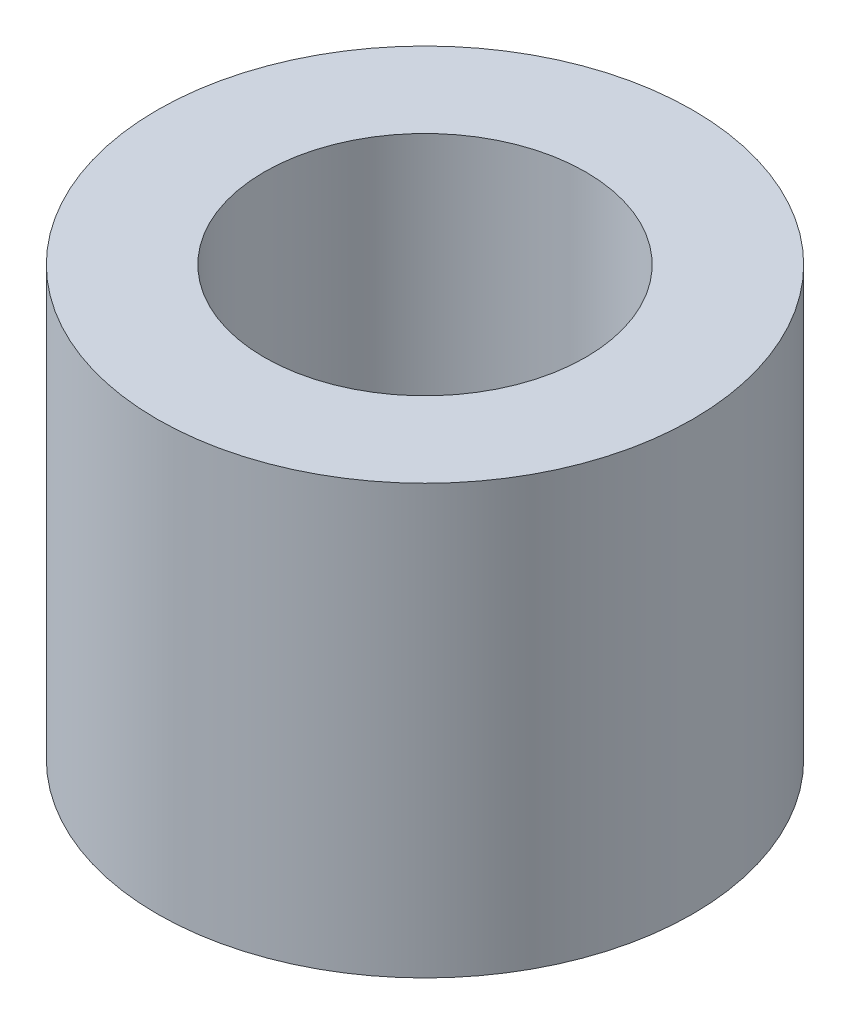
ISO-10303-21;
HEADER;
FILE_DESCRIPTION(('STEP AP214'),'2;1');
FILE_NAME('part.step','',(''),(''),'','','');
FILE_SCHEMA(('AUTOMOTIVE_DESIGN { 1 0 10303 214 1 1 1 1 }'));
ENDSEC;
DATA;
#1=APPLICATION_CONTEXT('core data for automotive mechanical design processes');
#2=APPLICATION_PROTOCOL_DEFINITION('international standard','automotive_design',2000,#1);
#3=PRODUCT_CONTEXT('',#1,'mechanical');
#4=PRODUCT('Part','Part','',(#3));
#5=PRODUCT_RELATED_PRODUCT_CATEGORY('part','',(#4));
#6=PRODUCT_DEFINITION_FORMATION('','',#4);
#7=PRODUCT_DEFINITION_CONTEXT('part definition',#1,'design');
#8=PRODUCT_DEFINITION('design','',#6,#7);
#9=PRODUCT_DEFINITION_SHAPE('','',#8);
#10=(LENGTH_UNIT() NAMED_UNIT(*) SI_UNIT(.MILLI.,.METRE.));
#11=(NAMED_UNIT(*) PLANE_ANGLE_UNIT() SI_UNIT($,.RADIAN.));
#12=(NAMED_UNIT(*) SI_UNIT($,.STERADIAN.) SOLID_ANGLE_UNIT());
#13=UNCERTAINTY_MEASURE_WITH_UNIT(LENGTH_MEASURE(1.E-05),#10,'distance_accuracy_value','');
#14=(GEOMETRIC_REPRESENTATION_CONTEXT(3) GLOBAL_UNCERTAINTY_ASSIGNED_CONTEXT((#13)) GLOBAL_UNIT_ASSIGNED_CONTEXT((#10,
#11,#12)) REPRESENTATION_CONTEXT('',''));
#15=CARTESIAN_POINT('',(0.,0.,0.));
#16=DIRECTION('',(0.,0.,1.));
#17=DIRECTION('',(1.,0.,0.));
#18=AXIS2_PLACEMENT_3D('',#15,#16,#17);
#19=CARTESIAN_POINT('',(0.,4.,0.));
#20=DIRECTION('',(0.,1.,0.));
#21=DIRECTION('',(0.,0.,1.));
#22=AXIS2_PLACEMENT_3D('',#19,#20,#21);
#23=PLANE('',#22);
#24=CARTESIAN_POINT('',(0.,4.,0.));
#25=DIRECTION('',(0.,1.,0.));
#26=DIRECTION('',(0.,0.,1.));
#27=AXIS2_PLACEMENT_3D('',#24,#25,#26);
#28=CIRCLE('',#27,2.5);
#29=CARTESIAN_POINT('',(0.,4.,2.5));
#30=VERTEX_POINT('',#29);
#31=EDGE_CURVE('E10',#30,#30,#28,.T.);
#32=ORIENTED_EDGE('',*,*,#31,.T.);
#33=EDGE_LOOP('',(#32));
#34=FACE_BOUND('',#33,.T.);
#35=CARTESIAN_POINT('',(0.,4.,0.));
#36=DIRECTION('',(0.,1.,0.));
#37=DIRECTION('',(0.,0.,1.));
#38=AXIS2_PLACEMENT_3D('',#35,#36,#37);
#39=CIRCLE('',#38,1.5);
#40=CARTESIAN_POINT('',(0.,4.,1.5));
#41=VERTEX_POINT('',#40);
#42=EDGE_CURVE('E42',#41,#41,#39,.T.);
#43=ORIENTED_EDGE('',*,*,#42,.F.);
#44=EDGE_LOOP('',(#43));
#45=FACE_BOUND('',#44,.T.);
#46=ADVANCED_FACE('F31',(#34,#45),#23,.T.);
#47=CARTESIAN_POINT('',(0.,0.,0.));
#48=DIRECTION('',(0.,1.,0.));
#49=DIRECTION('',(0.,0.,1.));
#50=AXIS2_PLACEMENT_3D('',#47,#48,#49);
#51=PLANE('',#50);
#52=CARTESIAN_POINT('',(0.,0.,0.));
#53=DIRECTION('',(0.,1.,0.));
#54=DIRECTION('',(0.,0.,1.));
#55=AXIS2_PLACEMENT_3D('',#52,#53,#54);
#56=CIRCLE('',#55,2.5);
#57=CARTESIAN_POINT('',(0.,0.,2.5));
#58=VERTEX_POINT('',#57);
#59=EDGE_CURVE('E35',#58,#58,#56,.T.);
#60=ORIENTED_EDGE('',*,*,#59,.F.);
#61=EDGE_LOOP('',(#60));
#62=FACE_BOUND('',#61,.T.);
#63=CARTESIAN_POINT('',(0.,0.,0.));
#64=DIRECTION('',(0.,1.,0.));
#65=DIRECTION('',(0.,0.,1.));
#66=AXIS2_PLACEMENT_3D('',#63,#64,#65);
#67=CIRCLE('',#66,1.5);
#68=CARTESIAN_POINT('',(0.,0.,1.5));
#69=VERTEX_POINT('',#68);
#70=EDGE_CURVE('E44',#69,#69,#67,.T.);
#71=ORIENTED_EDGE('',*,*,#70,.T.);
#72=EDGE_LOOP('',(#71));
#73=FACE_BOUND('',#72,.T.);
#74=ADVANCED_FACE('F54',(#62,#73),#51,.F.);
#75=CARTESIAN_POINT('',(0.,4.,0.));
#76=DIRECTION('',(0.,-1.,0.));
#77=DIRECTION('',(0.,0.,-1.));
#78=AXIS2_PLACEMENT_3D('',#75,#76,#77);
#79=CYLINDRICAL_SURFACE('',#78,2.5);
#80=ORIENTED_EDGE('',*,*,#31,.F.);
#81=EDGE_LOOP('',(#80));
#82=FACE_BOUND('',#81,.T.);
#83=ORIENTED_EDGE('',*,*,#59,.T.);
#84=EDGE_LOOP('',(#83));
#85=FACE_BOUND('',#84,.T.);
#86=ADVANCED_FACE('F33',(#82,#85),#79,.T.);
#87=CARTESIAN_POINT('',(0.,4.,0.));
#88=DIRECTION('',(0.,-1.,0.));
#89=DIRECTION('',(0.,0.,-1.));
#90=AXIS2_PLACEMENT_3D('',#87,#88,#89);
#91=CYLINDRICAL_SURFACE('',#90,1.5);
#92=ORIENTED_EDGE('',*,*,#42,.T.);
#93=EDGE_LOOP('',(#92));
#94=FACE_BOUND('',#93,.T.);
#95=ORIENTED_EDGE('',*,*,#70,.F.);
#96=EDGE_LOOP('',(#95));
#97=FACE_BOUND('',#96,.T.);
#98=ADVANCED_FACE('F50',(#94,#97),#91,.F.);
#99=CLOSED_SHELL('',(#46,#74,#86,#98));
#100=MANIFOLD_SOLID_BREP('B2',#99);
#101=ADVANCED_BREP_SHAPE_REPRESENTATION('',(#18,#100),#14);
#102=SHAPE_DEFINITION_REPRESENTATION(#9,#101);
ENDSEC;
END-ISO-10303-21;
